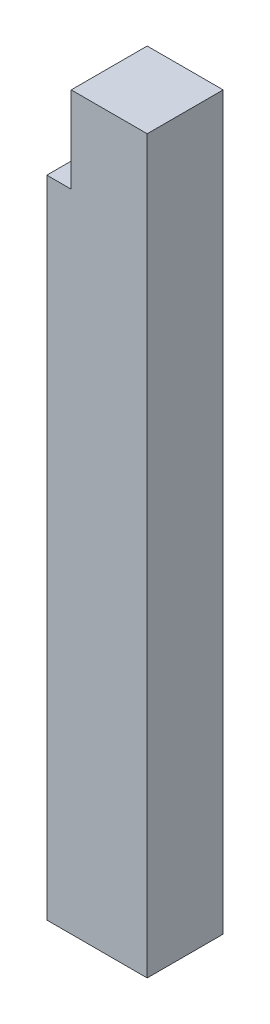
ISO-10303-21;
HEADER;
FILE_DESCRIPTION(('STEP AP214'),'2;1');
FILE_NAME('part.step','',(''),(''),'','','');
FILE_SCHEMA(('AUTOMOTIVE_DESIGN { 1 0 10303 214 1 1 1 1 }'));
ENDSEC;
DATA;
#1=APPLICATION_CONTEXT('core data for automotive mechanical design processes');
#2=APPLICATION_PROTOCOL_DEFINITION('international standard','automotive_design',2000,#1);
#3=PRODUCT_CONTEXT('',#1,'mechanical');
#4=PRODUCT('Part','Part','',(#3));
#5=PRODUCT_RELATED_PRODUCT_CATEGORY('part','',(#4));
#6=PRODUCT_DEFINITION_FORMATION('','',#4);
#7=PRODUCT_DEFINITION_CONTEXT('part definition',#1,'design');
#8=PRODUCT_DEFINITION('design','',#6,#7);
#9=PRODUCT_DEFINITION_SHAPE('','',#8);
#10=(LENGTH_UNIT() NAMED_UNIT(*) SI_UNIT(.MILLI.,.METRE.));
#11=(NAMED_UNIT(*) PLANE_ANGLE_UNIT() SI_UNIT($,.RADIAN.));
#12=(NAMED_UNIT(*) SI_UNIT($,.STERADIAN.) SOLID_ANGLE_UNIT());
#13=UNCERTAINTY_MEASURE_WITH_UNIT(LENGTH_MEASURE(1.E-05),#10,'distance_accuracy_value','');
#14=(GEOMETRIC_REPRESENTATION_CONTEXT(3) GLOBAL_UNCERTAINTY_ASSIGNED_CONTEXT((#13)) GLOBAL_UNIT_ASSIGNED_CONTEXT((#10,
#11,#12)) REPRESENTATION_CONTEXT('',''));
#15=CARTESIAN_POINT('',(0.,0.,0.));
#16=DIRECTION('',(0.,0.,1.));
#17=DIRECTION('',(1.,0.,0.));
#18=AXIS2_PLACEMENT_3D('',#15,#16,#17);
#19=CARTESIAN_POINT('',(0.,45.,0.));
#20=DIRECTION('',(0.,-1.,0.));
#21=DIRECTION('',(0.,0.,-1.));
#22=AXIS2_PLACEMENT_3D('',#19,#20,#21);
#23=PLANE('',#22);
#24=DIRECTION('',(0.,0.,1.));
#25=VECTOR('',#24,1.);
#26=CARTESIAN_POINT('',(-1.72913735608171,45.,-2.70365314468099));
#27=LINE('',#26,#25);
#28=CARTESIAN_POINT('',(-1.72913735608171,45.,-2.70365314468099));
#29=VERTEX_POINT('',#28);
#30=CARTESIAN_POINT('',(-1.72913735608171,45.,-0.875));
#31=VERTEX_POINT('',#30);
#32=EDGE_CURVE('E143',#29,#31,#27,.T.);
#33=ORIENTED_EDGE('',*,*,#32,.F.);
#34=DIRECTION('',(-1.,0.,0.));
#35=VECTOR('',#34,1.);
#36=CARTESIAN_POINT('',(-3.42913735608171,45.,-2.70365314468099));
#37=LINE('',#36,#35);
#38=CARTESIAN_POINT('',(-3.42913735608171,45.,-2.70365314468099));
#39=VERTEX_POINT('',#38);
#40=EDGE_CURVE('E195',#29,#39,#37,.T.);
#41=ORIENTED_EDGE('',*,*,#40,.T.);
#42=DIRECTION('',(0.,0.,1.));
#43=VECTOR('',#42,1.);
#44=CARTESIAN_POINT('',(-3.42913735608171,45.,-0.875));
#45=LINE('',#44,#43);
#46=CARTESIAN_POINT('',(-3.42913735608171,45.,-0.875));
#47=VERTEX_POINT('',#46);
#48=EDGE_CURVE('E196',#39,#47,#45,.T.);
#49=ORIENTED_EDGE('',*,*,#48,.T.);
#50=DIRECTION('',(1.,0.,0.));
#51=VECTOR('',#50,1.);
#52=CARTESIAN_POINT('',(-3.42913735608171,45.,-0.875));
#53=LINE('',#52,#51);
#54=EDGE_CURVE('E239',#47,#31,#53,.T.);
#55=ORIENTED_EDGE('',*,*,#54,.T.);
#56=EDGE_LOOP('',(#33,#41,#49,#55));
#57=FACE_BOUND('',#56,.T.);
#58=ADVANCED_FACE('F35',(#57),#23,.F.);
#59=CARTESIAN_POINT('',(-1.72913735608171,45.,0.875));
#60=VERTEX_POINT('',#59);
#61=CARTESIAN_POINT('',(-1.72913735608171,45.,2.59634685531901));
#62=VERTEX_POINT('',#61);
#63=EDGE_CURVE('E11',#60,#62,#27,.T.);
#64=ORIENTED_EDGE('',*,*,#63,.F.);
#65=DIRECTION('',(-1.,0.,0.));
#66=VECTOR('',#65,1.);
#67=CARTESIAN_POINT('',(-3.42913735608171,45.,0.875));
#68=LINE('',#67,#66);
#69=CARTESIAN_POINT('',(-3.42913735608171,45.,0.875));
#70=VERTEX_POINT('',#69);
#71=EDGE_CURVE('E185',#60,#70,#68,.T.);
#72=ORIENTED_EDGE('',*,*,#71,.T.);
#73=DIRECTION('',(0.,0.,1.));
#74=VECTOR('',#73,1.);
#75=CARTESIAN_POINT('',(-3.42913735608171,45.,2.59634685531901));
#76=LINE('',#75,#74);
#77=CARTESIAN_POINT('',(-3.42913735608171,45.,2.59634685531901));
#78=VERTEX_POINT('',#77);
#79=EDGE_CURVE('E184',#70,#78,#76,.T.);
#80=ORIENTED_EDGE('',*,*,#79,.T.);
#81=DIRECTION('',(1.,0.,0.));
#82=VECTOR('',#81,1.);
#83=CARTESIAN_POINT('',(-3.42913735608171,45.,2.59634685531901));
#84=LINE('',#83,#82);
#85=EDGE_CURVE('E171',#78,#62,#84,.T.);
#86=ORIENTED_EDGE('',*,*,#85,.T.);
#87=EDGE_LOOP('',(#64,#72,#80,#86));
#88=FACE_BOUND('',#87,.T.);
#89=ADVANCED_FACE('F242',(#88),#23,.F.);
#90=CARTESIAN_POINT('',(3.57086264391829,45.,2.59634685531901));
#91=DIRECTION('',(-1.,0.,0.));
#92=DIRECTION('',(0.,0.,1.));
#93=AXIS2_PLACEMENT_3D('',#90,#91,#92);
#94=PLANE('',#93);
#95=DIRECTION('',(0.,0.,-1.));
#96=VECTOR('',#95,1.);
#97=CARTESIAN_POINT('',(3.57086264391829,0.,2.59634685531901));
#98=LINE('',#97,#96);
#99=CARTESIAN_POINT('',(3.57086264391829,0.,2.59634685531901));
#100=VERTEX_POINT('',#99);
#101=CARTESIAN_POINT('',(3.57086264391829,0.,-2.70365314468099));
#102=VERTEX_POINT('',#101);
#103=EDGE_CURVE('E125',#100,#102,#98,.T.);
#104=ORIENTED_EDGE('',*,*,#103,.T.);
#105=DIRECTION('',(0.,-1.,0.));
#106=VECTOR('',#105,1.);
#107=CARTESIAN_POINT('',(3.57086264391829,45.,-2.70365314468099));
#108=LINE('',#107,#106);
#109=CARTESIAN_POINT('',(3.57086264391829,51.,-2.70365314468099));
#110=VERTEX_POINT('',#109);
#111=EDGE_CURVE('E44',#110,#102,#108,.T.);
#112=ORIENTED_EDGE('',*,*,#111,.F.);
#113=DIRECTION('',(0.,0.,-1.));
#114=VECTOR('',#113,1.);
#115=CARTESIAN_POINT('',(3.57086264391829,51.,-2.70365314468099));
#116=LINE('',#115,#114);
#117=CARTESIAN_POINT('',(3.57086264391829,51.,2.59634685531901));
#118=VERTEX_POINT('',#117);
#119=EDGE_CURVE('E123',#118,#110,#116,.T.);
#120=ORIENTED_EDGE('',*,*,#119,.F.);
#121=DIRECTION('',(0.,-1.,0.));
#122=VECTOR('',#121,1.);
#123=CARTESIAN_POINT('',(3.57086264391829,45.,2.59634685531901));
#124=LINE('',#123,#122);
#125=EDGE_CURVE('E194',#118,#100,#124,.T.);
#126=ORIENTED_EDGE('',*,*,#125,.T.);
#127=EDGE_LOOP('',(#104,#112,#120,#126));
#128=FACE_BOUND('',#127,.T.);
#129=ADVANCED_FACE('F37',(#128),#94,.F.);
#130=CARTESIAN_POINT('',(-3.42913735608171,45.,-2.70365314468099));
#131=DIRECTION('',(0.,0.,1.));
#132=DIRECTION('',(1.,0.,0.));
#133=AXIS2_PLACEMENT_3D('',#130,#131,#132);
#134=PLANE('',#133);
#135=DIRECTION('',(-1.,0.,0.));
#136=VECTOR('',#135,1.);
#137=CARTESIAN_POINT('',(-3.42913735608171,0.,-2.70365314468099));
#138=LINE('',#137,#136);
#139=CARTESIAN_POINT('',(-3.42913735608171,0.,-2.70365314468099));
#140=VERTEX_POINT('',#139);
#141=EDGE_CURVE('E163',#102,#140,#138,.T.);
#142=ORIENTED_EDGE('',*,*,#141,.T.);
#143=DIRECTION('',(0.,-1.,0.));
#144=VECTOR('',#143,1.);
#145=CARTESIAN_POINT('',(-3.42913735608171,45.,-2.70365314468099));
#146=LINE('',#145,#144);
#147=EDGE_CURVE('E127',#39,#140,#146,.T.);
#148=ORIENTED_EDGE('',*,*,#147,.F.);
#149=ORIENTED_EDGE('',*,*,#40,.F.);
#150=DIRECTION('',(0.,-1.,0.));
#151=VECTOR('',#150,1.);
#152=CARTESIAN_POINT('',(-1.72913735608171,51.,-2.70365314468099));
#153=LINE('',#152,#151);
#154=CARTESIAN_POINT('',(-1.72913735608171,51.,-2.70365314468099));
#155=VERTEX_POINT('',#154);
#156=EDGE_CURVE('E134',#155,#29,#153,.T.);
#157=ORIENTED_EDGE('',*,*,#156,.F.);
#158=DIRECTION('',(-1.,0.,0.));
#159=VECTOR('',#158,1.);
#160=CARTESIAN_POINT('',(3.57086264391829,51.,-2.70365314468099));
#161=LINE('',#160,#159);
#162=EDGE_CURVE('E130',#110,#155,#161,.T.);
#163=ORIENTED_EDGE('',*,*,#162,.F.);
#164=ORIENTED_EDGE('',*,*,#111,.T.);
#165=EDGE_LOOP('',(#142,#148,#149,#157,#163,#164));
#166=FACE_BOUND('',#165,.T.);
#167=ADVANCED_FACE('F131',(#166),#134,.F.);
#168=CARTESIAN_POINT('',(-3.42913735608171,45.,-0.875));
#169=DIRECTION('',(1.,0.,0.));
#170=DIRECTION('',(0.,0.,-1.));
#171=AXIS2_PLACEMENT_3D('',#168,#169,#170);
#172=PLANE('',#171);
#173=DIRECTION('',(0.,0.,1.));
#174=VECTOR('',#173,1.);
#175=CARTESIAN_POINT('',(-3.42913735608171,0.,-0.875));
#176=LINE('',#175,#174);
#177=CARTESIAN_POINT('',(-3.42913735608171,0.,-0.875));
#178=VERTEX_POINT('',#177);
#179=EDGE_CURVE('E224',#140,#178,#176,.T.);
#180=ORIENTED_EDGE('',*,*,#179,.T.);
#181=DIRECTION('',(0.,-1.,0.));
#182=VECTOR('',#181,1.);
#183=CARTESIAN_POINT('',(-3.42913735608171,45.,-0.875));
#184=LINE('',#183,#182);
#185=EDGE_CURVE('E201',#47,#178,#184,.T.);
#186=ORIENTED_EDGE('',*,*,#185,.F.);
#187=ORIENTED_EDGE('',*,*,#48,.F.);
#188=ORIENTED_EDGE('',*,*,#147,.T.);
#189=EDGE_LOOP('',(#180,#186,#187,#188));
#190=FACE_BOUND('',#189,.T.);
#191=ADVANCED_FACE('F230',(#190),#172,.F.);
#192=CARTESIAN_POINT('',(-3.42913735608171,45.,-0.875));
#193=DIRECTION('',(0.,0.,-1.));
#194=DIRECTION('',(-1.,0.,0.));
#195=AXIS2_PLACEMENT_3D('',#192,#193,#194);
#196=PLANE('',#195);
#197=DIRECTION('',(1.,0.,0.));
#198=VECTOR('',#197,1.);
#199=CARTESIAN_POINT('',(-3.42913735608171,0.,-0.875));
#200=LINE('',#199,#198);
#201=CARTESIAN_POINT('',(0.959612498531039,0.,-0.875));
#202=VERTEX_POINT('',#201);
#203=EDGE_CURVE('E222',#178,#202,#200,.T.);
#204=ORIENTED_EDGE('',*,*,#203,.T.);
#205=DIRECTION('',(0.,-1.,0.));
#206=VECTOR('',#205,1.);
#207=CARTESIAN_POINT('',(0.959612498531039,45.,-0.875));
#208=LINE('',#207,#206);
#209=CARTESIAN_POINT('',(0.959612498531039,45.,-0.875));
#210=VERTEX_POINT('',#209);
#211=EDGE_CURVE('E204',#210,#202,#208,.T.);
#212=ORIENTED_EDGE('',*,*,#211,.F.);
#213=EDGE_CURVE('E58',#31,#210,#53,.T.);
#214=ORIENTED_EDGE('',*,*,#213,.F.);
#215=ORIENTED_EDGE('',*,*,#54,.F.);
#216=ORIENTED_EDGE('',*,*,#185,.T.);
#217=EDGE_LOOP('',(#204,#212,#214,#215,#216));
#218=FACE_BOUND('',#217,.T.);
#219=ADVANCED_FACE('F236',(#218),#196,.F.);
#220=CARTESIAN_POINT('',(0.959612498531039,45.,0.875));
#221=DIRECTION('',(1.,0.,0.));
#222=DIRECTION('',(0.,0.,-1.));
#223=AXIS2_PLACEMENT_3D('',#220,#221,#222);
#224=PLANE('',#223);
#225=DIRECTION('',(0.,0.,1.));
#226=VECTOR('',#225,1.);
#227=CARTESIAN_POINT('',(0.959612498531039,0.,0.875));
#228=LINE('',#227,#226);
#229=CARTESIAN_POINT('',(0.959612498531039,0.,0.875));
#230=VERTEX_POINT('',#229);
#231=EDGE_CURVE('E220',#202,#230,#228,.T.);
#232=ORIENTED_EDGE('',*,*,#231,.T.);
#233=DIRECTION('',(0.,-1.,0.));
#234=VECTOR('',#233,1.);
#235=CARTESIAN_POINT('',(0.959612498531039,45.,0.875));
#236=LINE('',#235,#234);
#237=CARTESIAN_POINT('',(0.959612498531039,45.,0.875));
#238=VERTEX_POINT('',#237);
#239=EDGE_CURVE('E207',#238,#230,#236,.T.);
#240=ORIENTED_EDGE('',*,*,#239,.F.);
#241=DIRECTION('',(0.,0.,1.));
#242=VECTOR('',#241,1.);
#243=CARTESIAN_POINT('',(0.959612498531039,45.,0.875));
#244=LINE('',#243,#242);
#245=EDGE_CURVE('E181',#210,#238,#244,.T.);
#246=ORIENTED_EDGE('',*,*,#245,.F.);
#247=ORIENTED_EDGE('',*,*,#211,.T.);
#248=EDGE_LOOP('',(#232,#240,#246,#247));
#249=FACE_BOUND('',#248,.T.);
#250=ADVANCED_FACE('F238',(#249),#224,.F.);
#251=CARTESIAN_POINT('',(-3.42913735608171,45.,0.875));
#252=DIRECTION('',(0.,0.,1.));
#253=DIRECTION('',(1.,0.,0.));
#254=AXIS2_PLACEMENT_3D('',#251,#252,#253);
#255=PLANE('',#254);
#256=DIRECTION('',(-1.,0.,0.));
#257=VECTOR('',#256,1.);
#258=CARTESIAN_POINT('',(-3.42913735608171,0.,0.875));
#259=LINE('',#258,#257);
#260=CARTESIAN_POINT('',(-3.42913735608171,0.,0.875));
#261=VERTEX_POINT('',#260);
#262=EDGE_CURVE('E218',#230,#261,#259,.T.);
#263=ORIENTED_EDGE('',*,*,#262,.T.);
#264=DIRECTION('',(0.,-1.,0.));
#265=VECTOR('',#264,1.);
#266=CARTESIAN_POINT('',(-3.42913735608171,45.,0.875));
#267=LINE('',#266,#265);
#268=EDGE_CURVE('E209',#70,#261,#267,.T.);
#269=ORIENTED_EDGE('',*,*,#268,.F.);
#270=ORIENTED_EDGE('',*,*,#71,.F.);
#271=EDGE_CURVE('E179',#238,#60,#68,.T.);
#272=ORIENTED_EDGE('',*,*,#271,.F.);
#273=ORIENTED_EDGE('',*,*,#239,.T.);
#274=EDGE_LOOP('',(#263,#269,#270,#272,#273));
#275=FACE_BOUND('',#274,.T.);
#276=ADVANCED_FACE('F257',(#275),#255,.F.);
#277=CARTESIAN_POINT('',(-3.42913735608171,45.,2.59634685531901));
#278=DIRECTION('',(1.,0.,0.));
#279=DIRECTION('',(0.,0.,-1.));
#280=AXIS2_PLACEMENT_3D('',#277,#278,#279);
#281=PLANE('',#280);
#282=DIRECTION('',(0.,0.,1.));
#283=VECTOR('',#282,1.);
#284=CARTESIAN_POINT('',(-3.42913735608171,0.,2.59634685531901));
#285=LINE('',#284,#283);
#286=CARTESIAN_POINT('',(-3.42913735608171,0.,2.59634685531901));
#287=VERTEX_POINT('',#286);
#288=EDGE_CURVE('E216',#261,#287,#285,.T.);
#289=ORIENTED_EDGE('',*,*,#288,.T.);
#290=DIRECTION('',(0.,-1.,0.));
#291=VECTOR('',#290,1.);
#292=CARTESIAN_POINT('',(-3.42913735608171,45.,2.59634685531901));
#293=LINE('',#292,#291);
#294=EDGE_CURVE('E212',#78,#287,#293,.T.);
#295=ORIENTED_EDGE('',*,*,#294,.F.);
#296=ORIENTED_EDGE('',*,*,#79,.F.);
#297=ORIENTED_EDGE('',*,*,#268,.T.);
#298=EDGE_LOOP('',(#289,#295,#296,#297));
#299=FACE_BOUND('',#298,.T.);
#300=ADVANCED_FACE('F254',(#299),#281,.F.);
#301=CARTESIAN_POINT('',(-3.42913735608171,45.,2.59634685531901));
#302=DIRECTION('',(0.,0.,-1.));
#303=DIRECTION('',(-1.,0.,0.));
#304=AXIS2_PLACEMENT_3D('',#301,#302,#303);
#305=PLANE('',#304);
#306=DIRECTION('',(1.,0.,0.));
#307=VECTOR('',#306,1.);
#308=CARTESIAN_POINT('',(-3.42913735608171,0.,2.59634685531901));
#309=LINE('',#308,#307);
#310=EDGE_CURVE('E197',#287,#100,#309,.T.);
#311=ORIENTED_EDGE('',*,*,#310,.T.);
#312=ORIENTED_EDGE('',*,*,#125,.F.);
#313=DIRECTION('',(1.,0.,0.));
#314=VECTOR('',#313,1.);
#315=CARTESIAN_POINT('',(3.57086264391829,51.,2.59634685531901));
#316=LINE('',#315,#314);
#317=CARTESIAN_POINT('',(-1.72913735608171,51.,2.59634685531901));
#318=VERTEX_POINT('',#317);
#319=EDGE_CURVE('E142',#318,#118,#316,.T.);
#320=ORIENTED_EDGE('',*,*,#319,.F.);
#321=DIRECTION('',(0.,-1.,0.));
#322=VECTOR('',#321,1.);
#323=CARTESIAN_POINT('',(-1.72913735608171,51.,2.59634685531901));
#324=LINE('',#323,#322);
#325=EDGE_CURVE('E151',#318,#62,#324,.T.);
#326=ORIENTED_EDGE('',*,*,#325,.T.);
#327=ORIENTED_EDGE('',*,*,#85,.F.);
#328=ORIENTED_EDGE('',*,*,#294,.T.);
#329=EDGE_LOOP('',(#311,#312,#320,#326,#327,#328));
#330=FACE_BOUND('',#329,.T.);
#331=ADVANCED_FACE('F169',(#330),#305,.F.);
#332=CARTESIAN_POINT('',(0.,0.,0.));
#333=DIRECTION('',(0.,-1.,0.));
#334=DIRECTION('',(0.,0.,-1.));
#335=AXIS2_PLACEMENT_3D('',#332,#333,#334);
#336=PLANE('',#335);
#337=ORIENTED_EDGE('',*,*,#103,.F.);
#338=ORIENTED_EDGE('',*,*,#310,.F.);
#339=ORIENTED_EDGE('',*,*,#288,.F.);
#340=ORIENTED_EDGE('',*,*,#262,.F.);
#341=ORIENTED_EDGE('',*,*,#231,.F.);
#342=ORIENTED_EDGE('',*,*,#203,.F.);
#343=ORIENTED_EDGE('',*,*,#179,.F.);
#344=ORIENTED_EDGE('',*,*,#141,.F.);
#345=EDGE_LOOP('',(#337,#338,#339,#340,#341,#342,#343,#344));
#346=FACE_BOUND('',#345,.T.);
#347=ADVANCED_FACE('F233',(#346),#336,.T.);
#348=CARTESIAN_POINT('',(-1.72913735608171,51.,-2.70365314468099));
#349=DIRECTION('',(1.,0.,0.));
#350=DIRECTION('',(0.,0.,-1.));
#351=AXIS2_PLACEMENT_3D('',#348,#349,#350);
#352=PLANE('',#351);
#353=ORIENTED_EDGE('',*,*,#32,.T.);
#354=EDGE_CURVE('E146',#31,#60,#27,.T.);
#355=ORIENTED_EDGE('',*,*,#354,.T.);
#356=ORIENTED_EDGE('',*,*,#63,.T.);
#357=ORIENTED_EDGE('',*,*,#325,.F.);
#358=DIRECTION('',(0.,0.,1.));
#359=VECTOR('',#358,1.);
#360=CARTESIAN_POINT('',(-1.72913735608171,51.,-2.70365314468099));
#361=LINE('',#360,#359);
#362=EDGE_CURVE('E137',#155,#318,#361,.T.);
#363=ORIENTED_EDGE('',*,*,#362,.F.);
#364=ORIENTED_EDGE('',*,*,#156,.T.);
#365=EDGE_LOOP('',(#353,#355,#356,#357,#363,#364));
#366=FACE_BOUND('',#365,.T.);
#367=ADVANCED_FACE('F172',(#366),#352,.F.);
#368=CARTESIAN_POINT('',(0.,51.,0.));
#369=DIRECTION('',(0.,-1.,0.));
#370=DIRECTION('',(0.,0.,-1.));
#371=AXIS2_PLACEMENT_3D('',#368,#369,#370);
#372=PLANE('',#371);
#373=ORIENTED_EDGE('',*,*,#119,.T.);
#374=ORIENTED_EDGE('',*,*,#162,.T.);
#375=ORIENTED_EDGE('',*,*,#362,.T.);
#376=ORIENTED_EDGE('',*,*,#319,.T.);
#377=EDGE_LOOP('',(#373,#374,#375,#376));
#378=FACE_BOUND('',#377,.T.);
#379=ADVANCED_FACE('F140',(#378),#372,.F.);
#380=CARTESIAN_POINT('',(0.,45.,0.));
#381=DIRECTION('',(0.,-1.,0.));
#382=DIRECTION('',(0.,0.,-1.));
#383=AXIS2_PLACEMENT_3D('',#380,#381,#382);
#384=PLANE('',#383);
#385=ORIENTED_EDGE('',*,*,#354,.F.);
#386=ORIENTED_EDGE('',*,*,#213,.T.);
#387=ORIENTED_EDGE('',*,*,#245,.T.);
#388=ORIENTED_EDGE('',*,*,#271,.T.);
#389=EDGE_LOOP('',(#385,#386,#387,#388));
#390=FACE_BOUND('',#389,.T.);
#391=ADVANCED_FACE('F176',(#390),#384,.T.);
#392=CLOSED_SHELL('',(#58,#89,#129,#167,#191,#219,#250,#276,#300,#331,#347,#367,#379,#391));
#393=MANIFOLD_SOLID_BREP('B2',#392);
#394=ADVANCED_BREP_SHAPE_REPRESENTATION('',(#18,#393),#14);
#395=SHAPE_DEFINITION_REPRESENTATION(#9,#394);
ENDSEC;
END-ISO-10303-21;
